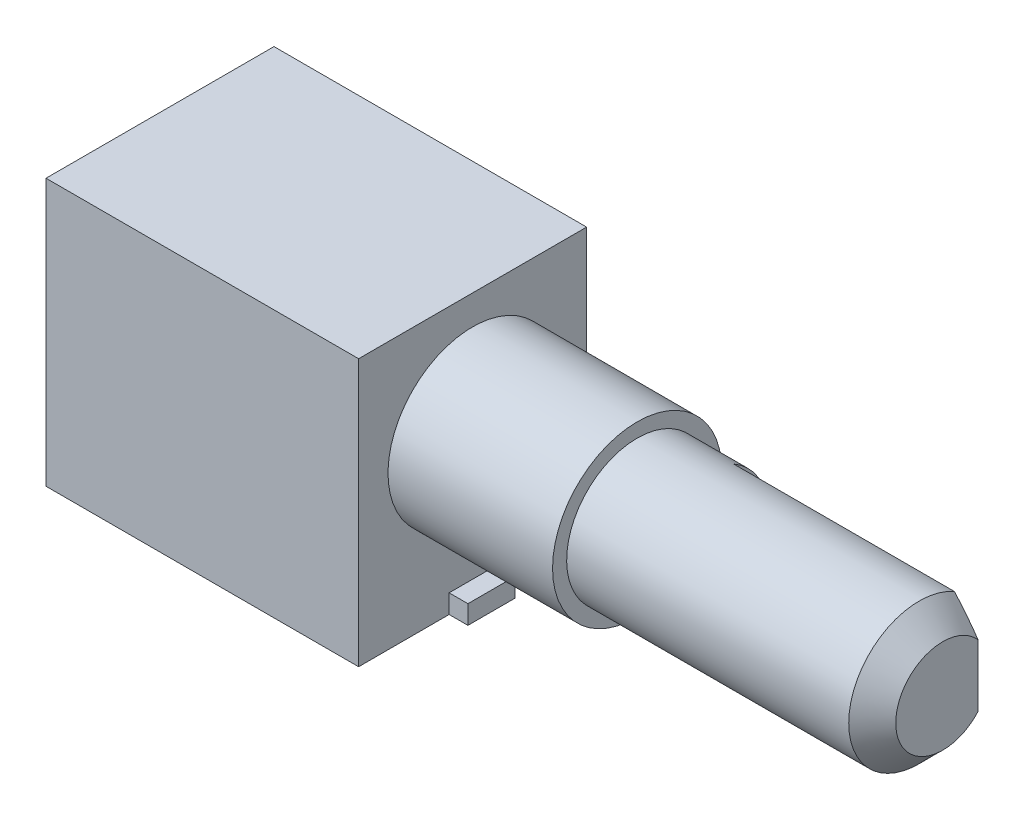
ISO-10303-21;
HEADER;
FILE_DESCRIPTION(('STEP AP214'),'2;1');
FILE_NAME('part.step','',(''),(''),'','','');
FILE_SCHEMA(('AUTOMOTIVE_DESIGN { 1 0 10303 214 1 1 1 1 }'));
ENDSEC;
DATA;
#1=APPLICATION_CONTEXT('core data for automotive mechanical design processes');
#2=APPLICATION_PROTOCOL_DEFINITION('international standard','automotive_design',2000,#1);
#3=PRODUCT_CONTEXT('',#1,'mechanical');
#4=PRODUCT('Part','Part','',(#3));
#5=PRODUCT_RELATED_PRODUCT_CATEGORY('part','',(#4));
#6=PRODUCT_DEFINITION_FORMATION('','',#4);
#7=PRODUCT_DEFINITION_CONTEXT('part definition',#1,'design');
#8=PRODUCT_DEFINITION('design','',#6,#7);
#9=PRODUCT_DEFINITION_SHAPE('','',#8);
#10=(LENGTH_UNIT() NAMED_UNIT(*) SI_UNIT(.MILLI.,.METRE.));
#11=(NAMED_UNIT(*) PLANE_ANGLE_UNIT() SI_UNIT($,.RADIAN.));
#12=(NAMED_UNIT(*) SI_UNIT($,.STERADIAN.) SOLID_ANGLE_UNIT());
#13=UNCERTAINTY_MEASURE_WITH_UNIT(LENGTH_MEASURE(1.E-05),#10,'distance_accuracy_value','');
#14=(GEOMETRIC_REPRESENTATION_CONTEXT(3) GLOBAL_UNCERTAINTY_ASSIGNED_CONTEXT((#13)) GLOBAL_UNIT_ASSIGNED_CONTEXT((#10,
#11,#12)) REPRESENTATION_CONTEXT('',''));
#15=CARTESIAN_POINT('',(0.,0.,0.));
#16=DIRECTION('',(0.,0.,1.));
#17=DIRECTION('',(1.,0.,0.));
#18=AXIS2_PLACEMENT_3D('',#15,#16,#17);
#19=CARTESIAN_POINT('',(13.3,0.,9.7));
#20=DIRECTION('',(-1.,0.,0.));
#21=DIRECTION('',(0.,-1.,0.));
#22=AXIS2_PLACEMENT_3D('',#19,#20,#21);
#23=PLANE('',#22);
#24=CARTESIAN_POINT('',(13.3,6.5,4.85));
#25=DIRECTION('',(-1.,0.,0.));
#26=DIRECTION('',(0.,-1.,0.));
#27=AXIS2_PLACEMENT_3D('',#24,#25,#26);
#28=CIRCLE('',#27,3.6);
#29=CARTESIAN_POINT('',(13.3,2.9,4.85));
#30=VERTEX_POINT('',#29);
#31=EDGE_CURVE('E204',#30,#30,#28,.F.);
#32=ORIENTED_EDGE('',*,*,#31,.F.);
#33=EDGE_LOOP('',(#32));
#34=FACE_BOUND('',#33,.T.);
#35=DIRECTION('',(0.,-1.,0.));
#36=VECTOR('',#35,1.);
#37=CARTESIAN_POINT('',(13.3,0.,5.85));
#38=LINE('',#37,#36);
#39=CARTESIAN_POINT('',(13.3,0.800000000000002,5.85));
#40=VERTEX_POINT('',#39);
#41=CARTESIAN_POINT('',(13.3,0.,5.85));
#42=VERTEX_POINT('',#41);
#43=EDGE_CURVE('E125',#40,#42,#38,.T.);
#44=ORIENTED_EDGE('',*,*,#43,.F.);
#45=DIRECTION('',(0.,0.,1.));
#46=VECTOR('',#45,1.);
#47=CARTESIAN_POINT('',(13.3,0.800000000000002,5.85));
#48=LINE('',#47,#46);
#49=CARTESIAN_POINT('',(13.3,0.800000000000002,3.85));
#50=VERTEX_POINT('',#49);
#51=EDGE_CURVE('E142',#50,#40,#48,.T.);
#52=ORIENTED_EDGE('',*,*,#51,.F.);
#53=DIRECTION('',(0.,1.,0.));
#54=VECTOR('',#53,1.);
#55=CARTESIAN_POINT('',(13.3,0.,3.85));
#56=LINE('',#55,#54);
#57=CARTESIAN_POINT('',(13.3,0.,3.85));
#58=VERTEX_POINT('',#57);
#59=EDGE_CURVE('E151',#58,#50,#56,.T.);
#60=ORIENTED_EDGE('',*,*,#59,.F.);
#61=DIRECTION('',(0.,0.,-1.));
#62=VECTOR('',#61,1.);
#63=CARTESIAN_POINT('',(13.3,0.,9.7));
#64=LINE('',#63,#62);
#65=CARTESIAN_POINT('',(13.3,0.,0.));
#66=VERTEX_POINT('',#65);
#67=EDGE_CURVE('E198',#58,#66,#64,.T.);
#68=ORIENTED_EDGE('',*,*,#67,.T.);
#69=DIRECTION('',(0.,1.,0.));
#70=VECTOR('',#69,1.);
#71=CARTESIAN_POINT('',(13.3,0.,0.));
#72=LINE('',#71,#70);
#73=CARTESIAN_POINT('',(13.3,11.35,0.));
#74=VERTEX_POINT('',#73);
#75=EDGE_CURVE('E190',#66,#74,#72,.T.);
#76=ORIENTED_EDGE('',*,*,#75,.T.);
#77=DIRECTION('',(0.,0.,-1.));
#78=VECTOR('',#77,1.);
#79=CARTESIAN_POINT('',(13.3,11.35,9.7));
#80=LINE('',#79,#78);
#81=CARTESIAN_POINT('',(13.3,11.35,9.7));
#82=VERTEX_POINT('',#81);
#83=EDGE_CURVE('E195',#82,#74,#80,.T.);
#84=ORIENTED_EDGE('',*,*,#83,.F.);
#85=DIRECTION('',(0.,1.,0.));
#86=VECTOR('',#85,1.);
#87=CARTESIAN_POINT('',(13.3,0.,9.7));
#88=LINE('',#87,#86);
#89=CARTESIAN_POINT('',(13.3,0.,9.7));
#90=VERTEX_POINT('',#89);
#91=EDGE_CURVE('E180',#90,#82,#88,.T.);
#92=ORIENTED_EDGE('',*,*,#91,.F.);
#93=EDGE_CURVE('E199',#90,#42,#64,.T.);
#94=ORIENTED_EDGE('',*,*,#93,.T.);
#95=EDGE_LOOP('',(#44,#52,#60,#68,#76,#84,#92,#94));
#96=FACE_BOUND('',#95,.T.);
#97=ADVANCED_FACE('F35',(#34,#96),#23,.F.);
#98=CARTESIAN_POINT('',(20.3,6.5,4.85));
#99=DIRECTION('',(1.,0.,0.));
#100=DIRECTION('',(0.,1.,0.));
#101=AXIS2_PLACEMENT_3D('',#98,#99,#100);
#102=PLANE('',#101);
#103=CARTESIAN_POINT('',(20.3,6.5,4.85));
#104=DIRECTION('',(1.,0.,0.));
#105=DIRECTION('',(0.,1.,0.));
#106=AXIS2_PLACEMENT_3D('',#103,#104,#105);
#107=CIRCLE('',#106,3.6);
#108=CARTESIAN_POINT('',(20.3,10.1,4.85));
#109=VERTEX_POINT('',#108);
#110=EDGE_CURVE('E170',#109,#109,#107,.T.);
#111=ORIENTED_EDGE('',*,*,#110,.T.);
#112=EDGE_LOOP('',(#111));
#113=FACE_BOUND('',#112,.T.);
#114=CARTESIAN_POINT('',(20.3,6.5,4.85));
#115=DIRECTION('',(1.,0.,0.));
#116=DIRECTION('',(0.,1.,0.));
#117=AXIS2_PLACEMENT_3D('',#114,#115,#116);
#118=CIRCLE('',#117,3.);
#119=CARTESIAN_POINT('',(20.3,9.5,4.85));
#120=VERTEX_POINT('',#119);
#121=EDGE_CURVE('E167',#120,#120,#118,.T.);
#122=ORIENTED_EDGE('',*,*,#121,.F.);
#123=EDGE_LOOP('',(#122));
#124=FACE_BOUND('',#123,.T.);
#125=ADVANCED_FACE('F244',(#113,#124),#102,.T.);
#126=CARTESIAN_POINT('',(0.,0.,9.7));
#127=DIRECTION('',(1.,0.,0.));
#128=DIRECTION('',(0.,0.,-1.));
#129=AXIS2_PLACEMENT_3D('',#126,#127,#128);
#130=PLANE('',#129);
#131=DIRECTION('',(0.,-1.,0.));
#132=VECTOR('',#131,1.);
#133=CARTESIAN_POINT('',(0.,0.,0.));
#134=LINE('',#133,#132);
#135=CARTESIAN_POINT('',(0.,11.35,0.));
#136=VERTEX_POINT('',#135);
#137=CARTESIAN_POINT('',(0.,0.,0.));
#138=VERTEX_POINT('',#137);
#139=EDGE_CURVE('E173',#136,#138,#134,.T.);
#140=ORIENTED_EDGE('',*,*,#139,.T.);
#141=DIRECTION('',(0.,0.,-1.));
#142=VECTOR('',#141,1.);
#143=CARTESIAN_POINT('',(0.,0.,9.7));
#144=LINE('',#143,#142);
#145=CARTESIAN_POINT('',(0.,0.,9.7));
#146=VERTEX_POINT('',#145);
#147=EDGE_CURVE('E201',#146,#138,#144,.T.);
#148=ORIENTED_EDGE('',*,*,#147,.F.);
#149=DIRECTION('',(0.,-1.,0.));
#150=VECTOR('',#149,1.);
#151=CARTESIAN_POINT('',(0.,0.,9.7));
#152=LINE('',#151,#150);
#153=CARTESIAN_POINT('',(0.,11.35,9.7));
#154=VERTEX_POINT('',#153);
#155=EDGE_CURVE('E174',#154,#146,#152,.T.);
#156=ORIENTED_EDGE('',*,*,#155,.F.);
#157=DIRECTION('',(0.,0.,-1.));
#158=VECTOR('',#157,1.);
#159=CARTESIAN_POINT('',(0.,11.35,9.7));
#160=LINE('',#159,#158);
#161=EDGE_CURVE('E184',#154,#136,#160,.T.);
#162=ORIENTED_EDGE('',*,*,#161,.T.);
#163=EDGE_LOOP('',(#140,#148,#156,#162));
#164=FACE_BOUND('',#163,.T.);
#165=ADVANCED_FACE('F247',(#164),#130,.F.);
#166=CARTESIAN_POINT('',(0.,0.,9.7));
#167=DIRECTION('',(0.,1.,0.));
#168=DIRECTION('',(0.,0.,1.));
#169=AXIS2_PLACEMENT_3D('',#166,#167,#168);
#170=PLANE('',#169);
#171=DIRECTION('',(1.,0.,0.));
#172=VECTOR('',#171,1.);
#173=CARTESIAN_POINT('',(0.,0.,0.));
#174=LINE('',#173,#172);
#175=EDGE_CURVE('E187',#138,#66,#174,.T.);
#176=ORIENTED_EDGE('',*,*,#175,.T.);
#177=ORIENTED_EDGE('',*,*,#67,.F.);
#178=DIRECTION('',(-1.,0.,0.));
#179=VECTOR('',#178,1.);
#180=CARTESIAN_POINT('',(14.1,0.,3.85));
#181=LINE('',#180,#179);
#182=CARTESIAN_POINT('',(14.1,0.,3.85));
#183=VERTEX_POINT('',#182);
#184=EDGE_CURVE('E161',#183,#58,#181,.T.);
#185=ORIENTED_EDGE('',*,*,#184,.F.);
#186=DIRECTION('',(0.,0.,-1.));
#187=VECTOR('',#186,1.);
#188=CARTESIAN_POINT('',(14.1,0.,5.85));
#189=LINE('',#188,#187);
#190=CARTESIAN_POINT('',(14.1,0.,5.85));
#191=VERTEX_POINT('',#190);
#192=EDGE_CURVE('E141',#191,#183,#189,.T.);
#193=ORIENTED_EDGE('',*,*,#192,.F.);
#194=DIRECTION('',(-1.,0.,0.));
#195=VECTOR('',#194,1.);
#196=CARTESIAN_POINT('',(14.1,0.,5.85));
#197=LINE('',#196,#195);
#198=EDGE_CURVE('E164',#191,#42,#197,.T.);
#199=ORIENTED_EDGE('',*,*,#198,.T.);
#200=ORIENTED_EDGE('',*,*,#93,.F.);
#201=DIRECTION('',(1.,0.,0.));
#202=VECTOR('',#201,1.);
#203=CARTESIAN_POINT('',(0.,0.,9.7));
#204=LINE('',#203,#202);
#205=EDGE_CURVE('E177',#146,#90,#204,.T.);
#206=ORIENTED_EDGE('',*,*,#205,.F.);
#207=ORIENTED_EDGE('',*,*,#147,.T.);
#208=EDGE_LOOP('',(#176,#177,#185,#193,#199,#200,#206,#207));
#209=FACE_BOUND('',#208,.T.);
#210=ADVANCED_FACE('F263',(#209),#170,.F.);
#211=CARTESIAN_POINT('',(0.,11.35,9.7));
#212=DIRECTION('',(0.,-1.,0.));
#213=DIRECTION('',(0.,0.,-1.));
#214=AXIS2_PLACEMENT_3D('',#211,#212,#213);
#215=PLANE('',#214);
#216=DIRECTION('',(-1.,0.,0.));
#217=VECTOR('',#216,1.);
#218=CARTESIAN_POINT('',(0.,11.35,0.));
#219=LINE('',#218,#217);
#220=EDGE_CURVE('E178',#74,#136,#219,.T.);
#221=ORIENTED_EDGE('',*,*,#220,.T.);
#222=ORIENTED_EDGE('',*,*,#161,.F.);
#223=DIRECTION('',(-1.,0.,0.));
#224=VECTOR('',#223,1.);
#225=CARTESIAN_POINT('',(0.,11.35,9.7));
#226=LINE('',#225,#224);
#227=EDGE_CURVE('E182',#82,#154,#226,.T.);
#228=ORIENTED_EDGE('',*,*,#227,.F.);
#229=ORIENTED_EDGE('',*,*,#83,.T.);
#230=EDGE_LOOP('',(#221,#222,#228,#229));
#231=FACE_BOUND('',#230,.T.);
#232=ADVANCED_FACE('F256',(#231),#215,.F.);
#233=CARTESIAN_POINT('',(0.,0.,9.7));
#234=DIRECTION('',(0.,0.,-1.));
#235=DIRECTION('',(-1.,0.,0.));
#236=AXIS2_PLACEMENT_3D('',#233,#234,#235);
#237=PLANE('',#236);
#238=ORIENTED_EDGE('',*,*,#155,.T.);
#239=ORIENTED_EDGE('',*,*,#205,.T.);
#240=ORIENTED_EDGE('',*,*,#91,.T.);
#241=ORIENTED_EDGE('',*,*,#227,.T.);
#242=EDGE_LOOP('',(#238,#239,#240,#241));
#243=FACE_BOUND('',#242,.T.);
#244=ADVANCED_FACE('F253',(#243),#237,.F.);
#245=CARTESIAN_POINT('',(0.,0.,0.));
#246=DIRECTION('',(0.,0.,-1.));
#247=DIRECTION('',(-1.,0.,0.));
#248=AXIS2_PLACEMENT_3D('',#245,#246,#247);
#249=PLANE('',#248);
#250=ORIENTED_EDGE('',*,*,#139,.F.);
#251=ORIENTED_EDGE('',*,*,#220,.F.);
#252=ORIENTED_EDGE('',*,*,#75,.F.);
#253=ORIENTED_EDGE('',*,*,#175,.F.);
#254=EDGE_LOOP('',(#250,#251,#252,#253));
#255=FACE_BOUND('',#254,.T.);
#256=ADVANCED_FACE('F251',(#255),#249,.T.);
#257=CARTESIAN_POINT('',(20.3,6.5,4.85));
#258=DIRECTION('',(-1.,0.,0.));
#259=DIRECTION('',(0.,-1.,0.));
#260=AXIS2_PLACEMENT_3D('',#257,#258,#259);
#261=CYLINDRICAL_SURFACE('',#260,3.6);
#262=ORIENTED_EDGE('',*,*,#110,.F.);
#263=EDGE_LOOP('',(#262));
#264=FACE_BOUND('',#263,.T.);
#265=ORIENTED_EDGE('',*,*,#31,.T.);
#266=EDGE_LOOP('',(#265));
#267=FACE_BOUND('',#266,.T.);
#268=ADVANCED_FACE('F243',(#264,#267),#261,.T.);
#269=CARTESIAN_POINT('',(61.7852813742386,6.50000000000001,4.85));
#270=DIRECTION('',(-1.,0.,0.));
#271=DIRECTION('',(0.,-1.,0.));
#272=AXIS2_PLACEMENT_3D('',#269,#270,#271);
#273=CYLINDRICAL_SURFACE('',#272,3.);
#274=DIRECTION('',(-1.,0.,0.));
#275=VECTOR('',#274,1.);
#276=CARTESIAN_POINT('',(61.7852813742386,3.90192378864669,3.35));
#277=LINE('',#276,#275);
#278=CARTESIAN_POINT('',(22.9,3.90192378864668,3.35));
#279=VERTEX_POINT('',#278);
#280=CARTESIAN_POINT('',(32.3,3.90192378864669,3.35));
#281=VERTEX_POINT('',#280);
#282=EDGE_CURVE('E126',#279,#281,#277,.F.);
#283=ORIENTED_EDGE('',*,*,#282,.T.);
#284=CARTESIAN_POINT('',(32.3,6.5,4.85));
#285=DIRECTION('',(-1.,0.,0.));
#286=DIRECTION('',(0.,0.,1.));
#287=AXIS2_PLACEMENT_3D('',#284,#285,#286);
#288=CIRCLE('',#287,3.);
#289=CARTESIAN_POINT('',(32.3,9.09807621135332,3.35));
#290=VERTEX_POINT('',#289);
#291=EDGE_CURVE('E123',#281,#290,#288,.T.);
#292=ORIENTED_EDGE('',*,*,#291,.T.);
#293=DIRECTION('',(-1.,0.,0.));
#294=VECTOR('',#293,1.);
#295=CARTESIAN_POINT('',(61.7852813742386,9.09807621135332,3.35));
#296=LINE('',#295,#294);
#297=CARTESIAN_POINT('',(22.9,9.09807621135332,3.35));
#298=VERTEX_POINT('',#297);
#299=EDGE_CURVE('E116',#290,#298,#296,.T.);
#300=ORIENTED_EDGE('',*,*,#299,.T.);
#301=CARTESIAN_POINT('',(22.9,6.5,4.85));
#302=DIRECTION('',(1.,0.,0.));
#303=DIRECTION('',(0.,0.,-1.));
#304=AXIS2_PLACEMENT_3D('',#301,#302,#303);
#305=CIRCLE('',#304,3.);
#306=EDGE_CURVE('E121',#279,#298,#305,.T.);
#307=ORIENTED_EDGE('',*,*,#306,.F.);
#308=EDGE_LOOP('',(#283,#292,#300,#307));
#309=FACE_BOUND('',#308,.T.);
#310=ORIENTED_EDGE('',*,*,#121,.T.);
#311=EDGE_LOOP('',(#310));
#312=FACE_BOUND('',#311,.T.);
#313=ADVANCED_FACE('F119',(#309,#312),#273,.T.);
#314=CARTESIAN_POINT('',(33.3,0.,9.7));
#315=DIRECTION('',(-1.,0.,0.));
#316=DIRECTION('',(0.,-1.,0.));
#317=AXIS2_PLACEMENT_3D('',#314,#315,#316);
#318=PLANE('',#317);
#319=DIRECTION('',(0.,1.,0.));
#320=VECTOR('',#319,1.);
#321=CARTESIAN_POINT('',(33.3,0.,3.35));
#322=LINE('',#321,#320);
#323=CARTESIAN_POINT('',(33.3,5.17712434446772,3.35));
#324=VERTEX_POINT('',#323);
#325=CARTESIAN_POINT('',(33.3,7.82287565553229,3.35));
#326=VERTEX_POINT('',#325);
#327=EDGE_CURVE('E132',#324,#326,#322,.T.);
#328=ORIENTED_EDGE('',*,*,#327,.T.);
#329=CARTESIAN_POINT('',(33.3,6.5,4.85));
#330=DIRECTION('',(-1.,0.,0.));
#331=DIRECTION('',(0.,-1.,0.));
#332=AXIS2_PLACEMENT_3D('',#329,#330,#331);
#333=CIRCLE('',#332,1.99999999999999);
#334=EDGE_CURVE('E12',#326,#324,#333,.F.);
#335=ORIENTED_EDGE('',*,*,#334,.T.);
#336=EDGE_LOOP('',(#328,#335));
#337=FACE_BOUND('',#336,.T.);
#338=ADVANCED_FACE('F237',(#337),#318,.F.);
#339=CARTESIAN_POINT('',(14.1,0.,5.85));
#340=DIRECTION('',(0.,0.,-1.));
#341=DIRECTION('',(-1.,0.,0.));
#342=AXIS2_PLACEMENT_3D('',#339,#340,#341);
#343=PLANE('',#342);
#344=ORIENTED_EDGE('',*,*,#43,.T.);
#345=ORIENTED_EDGE('',*,*,#198,.F.);
#346=DIRECTION('',(0.,-1.,0.));
#347=VECTOR('',#346,1.);
#348=CARTESIAN_POINT('',(14.1,0.,5.85));
#349=LINE('',#348,#347);
#350=CARTESIAN_POINT('',(14.1,0.800000000000002,5.85));
#351=VERTEX_POINT('',#350);
#352=EDGE_CURVE('E138',#351,#191,#349,.T.);
#353=ORIENTED_EDGE('',*,*,#352,.F.);
#354=DIRECTION('',(-1.,0.,0.));
#355=VECTOR('',#354,1.);
#356=CARTESIAN_POINT('',(14.1,0.800000000000002,5.85));
#357=LINE('',#356,#355);
#358=EDGE_CURVE('E148',#351,#40,#357,.T.);
#359=ORIENTED_EDGE('',*,*,#358,.T.);
#360=EDGE_LOOP('',(#344,#345,#353,#359));
#361=FACE_BOUND('',#360,.T.);
#362=ADVANCED_FACE('F233',(#361),#343,.F.);
#363=CARTESIAN_POINT('',(14.1,0.,3.85));
#364=DIRECTION('',(0.,0.,1.));
#365=DIRECTION('',(1.,0.,0.));
#366=AXIS2_PLACEMENT_3D('',#363,#364,#365);
#367=PLANE('',#366);
#368=ORIENTED_EDGE('',*,*,#59,.T.);
#369=DIRECTION('',(-1.,0.,0.));
#370=VECTOR('',#369,1.);
#371=CARTESIAN_POINT('',(14.1,0.800000000000002,3.85));
#372=LINE('',#371,#370);
#373=CARTESIAN_POINT('',(14.1,0.800000000000002,3.85));
#374=VERTEX_POINT('',#373);
#375=EDGE_CURVE('E158',#374,#50,#372,.T.);
#376=ORIENTED_EDGE('',*,*,#375,.F.);
#377=DIRECTION('',(0.,1.,0.));
#378=VECTOR('',#377,1.);
#379=CARTESIAN_POINT('',(14.1,0.,3.85));
#380=LINE('',#379,#378);
#381=EDGE_CURVE('E144',#183,#374,#380,.T.);
#382=ORIENTED_EDGE('',*,*,#381,.F.);
#383=ORIENTED_EDGE('',*,*,#184,.T.);
#384=EDGE_LOOP('',(#368,#376,#382,#383));
#385=FACE_BOUND('',#384,.T.);
#386=ADVANCED_FACE('F229',(#385),#367,.F.);
#387=CARTESIAN_POINT('',(14.1,0.800000000000002,5.85));
#388=DIRECTION('',(0.,-1.,0.));
#389=DIRECTION('',(1.,0.,0.));
#390=AXIS2_PLACEMENT_3D('',#387,#388,#389);
#391=PLANE('',#390);
#392=ORIENTED_EDGE('',*,*,#51,.T.);
#393=ORIENTED_EDGE('',*,*,#358,.F.);
#394=DIRECTION('',(0.,0.,1.));
#395=VECTOR('',#394,1.);
#396=CARTESIAN_POINT('',(14.1,0.800000000000002,5.85));
#397=LINE('',#396,#395);
#398=EDGE_CURVE('E146',#374,#351,#397,.T.);
#399=ORIENTED_EDGE('',*,*,#398,.F.);
#400=ORIENTED_EDGE('',*,*,#375,.T.);
#401=EDGE_LOOP('',(#392,#393,#399,#400));
#402=FACE_BOUND('',#401,.T.);
#403=ADVANCED_FACE('F225',(#402),#391,.F.);
#404=CARTESIAN_POINT('',(14.1,0.,0.));
#405=DIRECTION('',(-1.,0.,0.));
#406=DIRECTION('',(0.,0.,1.));
#407=AXIS2_PLACEMENT_3D('',#404,#405,#406);
#408=PLANE('',#407);
#409=ORIENTED_EDGE('',*,*,#352,.T.);
#410=ORIENTED_EDGE('',*,*,#192,.T.);
#411=ORIENTED_EDGE('',*,*,#381,.T.);
#412=ORIENTED_EDGE('',*,*,#398,.T.);
#413=EDGE_LOOP('',(#409,#410,#411,#412));
#414=FACE_BOUND('',#413,.T.);
#415=ADVANCED_FACE('F221',(#414),#408,.F.);
#416=CARTESIAN_POINT('',(22.9,0.,0.));
#417=DIRECTION('',(1.,0.,0.));
#418=DIRECTION('',(0.,0.,-1.));
#419=AXIS2_PLACEMENT_3D('',#416,#417,#418);
#420=PLANE('',#419);
#421=ORIENTED_EDGE('',*,*,#306,.T.);
#422=DIRECTION('',(0.,-1.,0.));
#423=VECTOR('',#422,1.);
#424=CARTESIAN_POINT('',(22.9,11.0314598187638,3.35));
#425=LINE('',#424,#423);
#426=EDGE_CURVE('E131',#298,#279,#425,.T.);
#427=ORIENTED_EDGE('',*,*,#426,.T.);
#428=EDGE_LOOP('',(#421,#427));
#429=FACE_BOUND('',#428,.T.);
#430=ADVANCED_FACE('F130',(#429),#420,.T.);
#431=CARTESIAN_POINT('',(22.9,11.0314598187638,3.35));
#432=DIRECTION('',(0.,0.,1.));
#433=DIRECTION('',(1.,0.,0.));
#434=AXIS2_PLACEMENT_3D('',#431,#432,#433);
#435=PLANE('',#434);
#436=ORIENTED_EDGE('',*,*,#299,.F.);
#437=CARTESIAN_POINT('',(32.3,9.09807621135332,3.35));
#438=CARTESIAN_POINT('',(32.3442381406059,9.04699202981894,3.35));
#439=CARTESIAN_POINT('',(32.3882923766867,8.99574934324269,3.35));
#440=CARTESIAN_POINT('',(32.4759619595321,8.89288833200145,3.35));
#441=CARTESIAN_POINT('',(32.5195772976773,8.8412699999935,3.35));
#442=CARTESIAN_POINT('',(32.6495728814006,8.68586566547732,3.35));
#443=CARTESIAN_POINT('',(32.7351875178623,8.58143291233701,3.35));
#444=CARTESIAN_POINT('',(32.8613953972222,8.4229673479984,3.35));
#445=CARTESIAN_POINT('',(32.9031081979567,8.36982608787187,3.35));
#446=CARTESIAN_POINT('',(32.9856064009514,8.26283273605453,3.35));
#447=CARTESIAN_POINT('',(33.0263918655651,8.20898069254343,3.35));
#448=CARTESIAN_POINT('',(33.1068591846631,8.10037667643988,3.35));
#449=CARTESIAN_POINT('',(33.1465399814917,8.04562391618776,3.35));
#450=CARTESIAN_POINT('',(33.2244455147962,7.93507460370071,3.35));
#451=CARTESIAN_POINT('',(33.2626699027791,7.87927780634972,3.35));
#452=CARTESIAN_POINT('',(33.3,7.82287565553229,3.35));
#453=B_SPLINE_CURVE_WITH_KNOTS('',3,(#437,#438,#439,#440,#441,#442,#443,#444,#445,#446,#447,
#448,#449,#450,#451,#452),.UNSPECIFIED.,.F.,.F.,(4,2,2,2,2,2,2,4),(0.,0.202728019806966,
0.405460013167093,0.810536547966818,1.0131998344623,1.2158494534792,1.41868685322817,
1.6215724874218),.UNSPECIFIED.);
#454=EDGE_CURVE('E44',#290,#326,#453,.T.);
#455=ORIENTED_EDGE('',*,*,#454,.T.);
#456=ORIENTED_EDGE('',*,*,#327,.F.);
#457=CARTESIAN_POINT('',(33.3,5.17712434446772,3.35));
#458=CARTESIAN_POINT('',(33.2626699027791,5.12072219365029,3.35));
#459=CARTESIAN_POINT('',(33.2244455147962,5.0649253962993,3.35));
#460=CARTESIAN_POINT('',(33.1465399814917,4.95437608381225,3.35));
#461=CARTESIAN_POINT('',(33.1068591846631,4.89962332356013,3.35));
#462=CARTESIAN_POINT('',(33.0263918655651,4.79101930745658,3.35));
#463=CARTESIAN_POINT('',(32.9856064009515,4.73716726394548,3.35));
#464=CARTESIAN_POINT('',(32.9031081979567,4.63017391212814,3.35));
#465=CARTESIAN_POINT('',(32.8613953972222,4.57703265200161,3.35));
#466=CARTESIAN_POINT('',(32.7351875178623,4.418567087663,3.35));
#467=CARTESIAN_POINT('',(32.6495728814006,4.31413433452268,3.35));
#468=CARTESIAN_POINT('',(32.5195772976773,4.1587300000065,3.35));
#469=CARTESIAN_POINT('',(32.4759619595321,4.10711166799855,3.35));
#470=CARTESIAN_POINT('',(32.3882923766867,4.00425065675732,3.35));
#471=CARTESIAN_POINT('',(32.3442381406059,3.95300797018106,3.35));
#472=CARTESIAN_POINT('',(32.3,3.90192378864669,3.35));
#473=B_SPLINE_CURVE_WITH_KNOTS('',3,(#457,#458,#459,#460,#461,#462,#463,#464,#465,#466,#467,
#468,#469,#470,#471,#472),.UNSPECIFIED.,.F.,.F.,(4,2,2,2,2,2,2,4),(0.,0.202885634193625,
0.405723033942593,0.608372652959491,0.811035939454984,1.21611247425471,1.41884446761484,
1.6215724874218),.UNSPECIFIED.);
#474=EDGE_CURVE('E209',#324,#281,#473,.T.);
#475=ORIENTED_EDGE('',*,*,#474,.T.);
#476=ORIENTED_EDGE('',*,*,#282,.F.);
#477=ORIENTED_EDGE('',*,*,#426,.F.);
#478=EDGE_LOOP('',(#436,#455,#456,#475,#476,#477));
#479=FACE_BOUND('',#478,.T.);
#480=ADVANCED_FACE('F134',(#479),#435,.F.);
#481=CARTESIAN_POINT('',(32.3,6.5,4.85));
#482=DIRECTION('',(-1.,0.,0.));
#483=DIRECTION('',(0.,0.,1.));
#484=AXIS2_PLACEMENT_3D('',#481,#482,#483);
#485=CONICAL_SURFACE('',#484,3.,0.785398163397448);
#486=ORIENTED_EDGE('',*,*,#474,.F.);
#487=ORIENTED_EDGE('',*,*,#334,.F.);
#488=ORIENTED_EDGE('',*,*,#454,.F.);
#489=ORIENTED_EDGE('',*,*,#291,.F.);
#490=EDGE_LOOP('',(#486,#487,#488,#489));
#491=FACE_BOUND('',#490,.T.);
#492=ADVANCED_FACE('F37',(#491),#485,.T.);
#493=CLOSED_SHELL('',(#97,#125,#165,#210,#232,#244,#256,#268,#313,#338,#362,#386,#403,#415,#430,
#480,#492));
#494=MANIFOLD_SOLID_BREP('B2',#493);
#495=ADVANCED_BREP_SHAPE_REPRESENTATION('',(#18,#494),#14);
#496=SHAPE_DEFINITION_REPRESENTATION(#9,#495);
ENDSEC;
END-ISO-10303-21;
